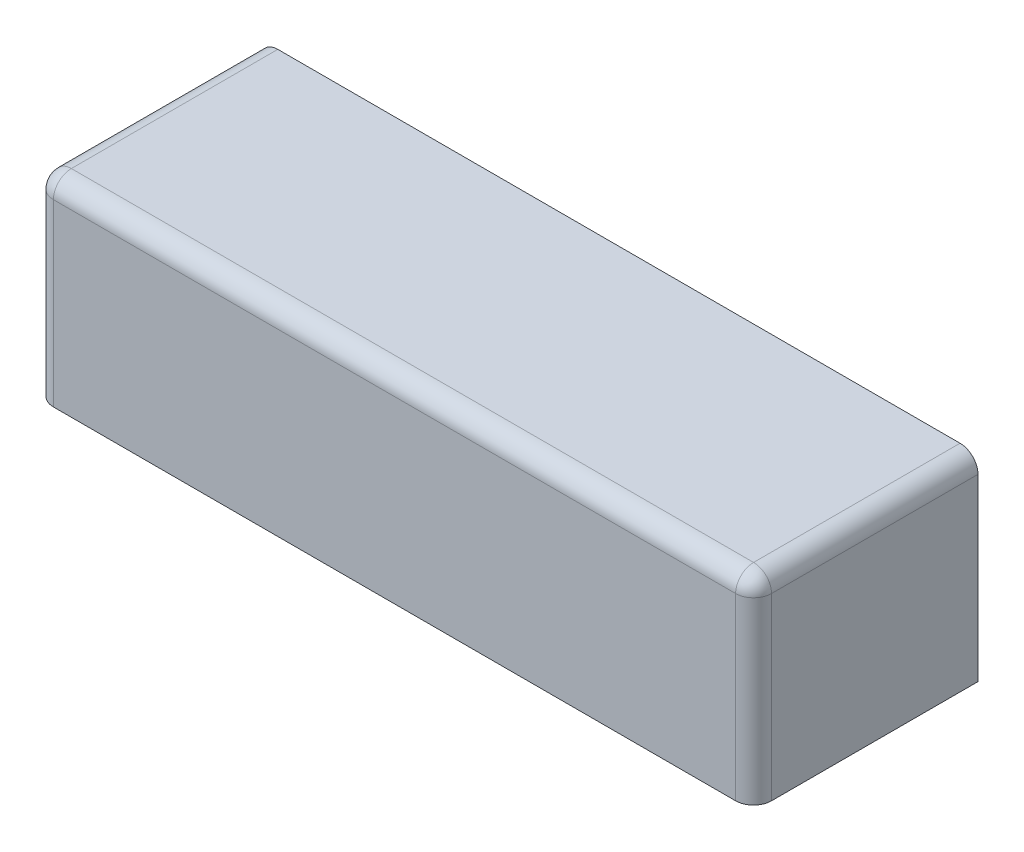
ISO-10303-21;
HEADER;
FILE_DESCRIPTION(('STEP AP214'),'2;1');
FILE_NAME('part.step','',(''),(''),'','','');
FILE_SCHEMA(('AUTOMOTIVE_DESIGN { 1 0 10303 214 1 1 1 1 }'));
ENDSEC;
DATA;
#1=APPLICATION_CONTEXT('core data for automotive mechanical design processes');
#2=APPLICATION_PROTOCOL_DEFINITION('international standard','automotive_design',2000,#1);
#3=PRODUCT_CONTEXT('',#1,'mechanical');
#4=PRODUCT('Part','Part','',(#3));
#5=PRODUCT_RELATED_PRODUCT_CATEGORY('part','',(#4));
#6=PRODUCT_DEFINITION_FORMATION('','',#4);
#7=PRODUCT_DEFINITION_CONTEXT('part definition',#1,'design');
#8=PRODUCT_DEFINITION('design','',#6,#7);
#9=PRODUCT_DEFINITION_SHAPE('','',#8);
#10=(LENGTH_UNIT() NAMED_UNIT(*) SI_UNIT(.MILLI.,.METRE.));
#11=(NAMED_UNIT(*) PLANE_ANGLE_UNIT() SI_UNIT($,.RADIAN.));
#12=(NAMED_UNIT(*) SI_UNIT($,.STERADIAN.) SOLID_ANGLE_UNIT());
#13=UNCERTAINTY_MEASURE_WITH_UNIT(LENGTH_MEASURE(1.E-05),#10,'distance_accuracy_value','');
#14=(GEOMETRIC_REPRESENTATION_CONTEXT(3) GLOBAL_UNCERTAINTY_ASSIGNED_CONTEXT((#13)) GLOBAL_UNIT_ASSIGNED_CONTEXT((#10,
#11,#12)) REPRESENTATION_CONTEXT('',''));
#15=CARTESIAN_POINT('',(0.,0.,0.));
#16=DIRECTION('',(0.,0.,1.));
#17=DIRECTION('',(1.,0.,0.));
#18=AXIS2_PLACEMENT_3D('',#15,#16,#17);
#19=CARTESIAN_POINT('',(-200.,-55.,125.));
#20=DIRECTION('',(0.,1.,0.));
#21=DIRECTION('',(0.,0.,1.));
#22=AXIS2_PLACEMENT_3D('',#19,#20,#21);
#23=PLANE('',#22);
#24=DIRECTION('',(0.,0.,-1.));
#25=VECTOR('',#24,1.);
#26=CARTESIAN_POINT('',(-197.,-55.,125.));
#27=LINE('',#26,#25);
#28=CARTESIAN_POINT('',(-197.,-55.,115.));
#29=VERTEX_POINT('',#28);
#30=CARTESIAN_POINT('',(-197.,-55.,0.));
#31=VERTEX_POINT('',#30);
#32=EDGE_CURVE('E199',#29,#31,#27,.T.);
#33=ORIENTED_EDGE('',*,*,#32,.F.);
#34=CARTESIAN_POINT('',(-190.,-55.,115.));
#35=DIRECTION('',(0.,1.,0.));
#36=DIRECTION('',(0.,0.,1.));
#37=AXIS2_PLACEMENT_3D('',#34,#35,#36);
#38=CIRCLE('',#37,7.);
#39=CARTESIAN_POINT('',(-190.,-55.,122.));
#40=VERTEX_POINT('',#39);
#41=EDGE_CURVE('E154',#40,#29,#38,.F.);
#42=ORIENTED_EDGE('',*,*,#41,.F.);
#43=DIRECTION('',(1.,0.,0.));
#44=VECTOR('',#43,1.);
#45=CARTESIAN_POINT('',(-200.,-55.,122.));
#46=LINE('',#45,#44);
#47=CARTESIAN_POINT('',(190.,-55.,122.));
#48=VERTEX_POINT('',#47);
#49=EDGE_CURVE('E204',#40,#48,#46,.T.);
#50=ORIENTED_EDGE('',*,*,#49,.T.);
#51=CARTESIAN_POINT('',(190.,-55.,115.));
#52=DIRECTION('',(0.,1.,0.));
#53=DIRECTION('',(0.,0.,1.));
#54=AXIS2_PLACEMENT_3D('',#51,#52,#53);
#55=CIRCLE('',#54,7.);
#56=CARTESIAN_POINT('',(197.,-55.,115.));
#57=VERTEX_POINT('',#56);
#58=EDGE_CURVE('E188',#57,#48,#55,.F.);
#59=ORIENTED_EDGE('',*,*,#58,.F.);
#60=DIRECTION('',(0.,0.,-1.));
#61=VECTOR('',#60,1.);
#62=CARTESIAN_POINT('',(197.,-55.,125.));
#63=LINE('',#62,#61);
#64=CARTESIAN_POINT('',(197.,-55.,0.));
#65=VERTEX_POINT('',#64);
#66=EDGE_CURVE('E159',#57,#65,#63,.T.);
#67=ORIENTED_EDGE('',*,*,#66,.T.);
#68=DIRECTION('',(1.,0.,0.));
#69=VECTOR('',#68,1.);
#70=CARTESIAN_POINT('',(-200.,-55.,0.));
#71=LINE('',#70,#69);
#72=CARTESIAN_POINT('',(200.,-55.,0.));
#73=VERTEX_POINT('',#72);
#74=EDGE_CURVE('E233',#65,#73,#71,.T.);
#75=ORIENTED_EDGE('',*,*,#74,.T.);
#76=DIRECTION('',(0.,0.,-1.));
#77=VECTOR('',#76,1.);
#78=CARTESIAN_POINT('',(200.,-55.,125.));
#79=LINE('',#78,#77);
#80=CARTESIAN_POINT('',(200.,-55.,115.));
#81=VERTEX_POINT('',#80);
#82=EDGE_CURVE('E223',#81,#73,#79,.T.);
#83=ORIENTED_EDGE('',*,*,#82,.F.);
#84=CARTESIAN_POINT('',(190.,-55.,115.));
#85=DIRECTION('',(0.,1.,0.));
#86=DIRECTION('',(0.,0.,1.));
#87=AXIS2_PLACEMENT_3D('',#84,#85,#86);
#88=CIRCLE('',#87,10.);
#89=CARTESIAN_POINT('',(190.,-55.,125.));
#90=VERTEX_POINT('',#89);
#91=EDGE_CURVE('E261',#81,#90,#88,.F.);
#92=ORIENTED_EDGE('',*,*,#91,.T.);
#93=DIRECTION('',(1.,0.,0.));
#94=VECTOR('',#93,1.);
#95=CARTESIAN_POINT('',(-200.,-55.,125.));
#96=LINE('',#95,#94);
#97=CARTESIAN_POINT('',(-190.,-55.,125.));
#98=VERTEX_POINT('',#97);
#99=EDGE_CURVE('E220',#98,#90,#96,.T.);
#100=ORIENTED_EDGE('',*,*,#99,.F.);
#101=CARTESIAN_POINT('',(-190.,-55.,115.));
#102=DIRECTION('',(0.,1.,0.));
#103=DIRECTION('',(0.,0.,1.));
#104=AXIS2_PLACEMENT_3D('',#101,#102,#103);
#105=CIRCLE('',#104,10.);
#106=CARTESIAN_POINT('',(-200.,-55.,115.));
#107=VERTEX_POINT('',#106);
#108=EDGE_CURVE('E263',#98,#107,#105,.F.);
#109=ORIENTED_EDGE('',*,*,#108,.T.);
#110=DIRECTION('',(0.,0.,-1.));
#111=VECTOR('',#110,1.);
#112=CARTESIAN_POINT('',(-200.,-55.,125.));
#113=LINE('',#112,#111);
#114=CARTESIAN_POINT('',(-200.,-55.,0.));
#115=VERTEX_POINT('',#114);
#116=EDGE_CURVE('E238',#107,#115,#113,.T.);
#117=ORIENTED_EDGE('',*,*,#116,.T.);
#118=EDGE_CURVE('E224',#115,#31,#71,.T.);
#119=ORIENTED_EDGE('',*,*,#118,.T.);
#120=EDGE_LOOP('',(#33,#42,#50,#59,#67,#75,#83,#92,#100,#109,#117,#119));
#121=FACE_BOUND('',#120,.T.);
#122=ADVANCED_FACE('F33',(#121),#23,.F.);
#123=CARTESIAN_POINT('',(200.,55.,125.));
#124=DIRECTION('',(-1.,0.,0.));
#125=DIRECTION('',(0.,0.,1.));
#126=AXIS2_PLACEMENT_3D('',#123,#124,#125);
#127=PLANE('',#126);
#128=DIRECTION('',(0.,0.,-1.));
#129=VECTOR('',#128,1.);
#130=CARTESIAN_POINT('',(200.,45.,125.));
#131=LINE('',#130,#129);
#132=CARTESIAN_POINT('',(200.,45.,0.));
#133=VERTEX_POINT('',#132);
#134=CARTESIAN_POINT('',(200.,45.,115.));
#135=VERTEX_POINT('',#134);
#136=EDGE_CURVE('E42',#133,#135,#131,.F.);
#137=ORIENTED_EDGE('',*,*,#136,.T.);
#138=DIRECTION('',(0.,1.,0.));
#139=VECTOR('',#138,1.);
#140=CARTESIAN_POINT('',(200.,-55.,115.));
#141=LINE('',#140,#139);
#142=EDGE_CURVE('E11',#135,#81,#141,.F.);
#143=ORIENTED_EDGE('',*,*,#142,.T.);
#144=ORIENTED_EDGE('',*,*,#82,.T.);
#145=DIRECTION('',(0.,1.,0.));
#146=VECTOR('',#145,1.);
#147=CARTESIAN_POINT('',(200.,55.,0.));
#148=LINE('',#147,#146);
#149=EDGE_CURVE('E225',#73,#133,#148,.T.);
#150=ORIENTED_EDGE('',*,*,#149,.T.);
#151=EDGE_LOOP('',(#137,#143,#144,#150));
#152=FACE_BOUND('',#151,.T.);
#153=ADVANCED_FACE('F347',(#152),#127,.F.);
#154=CARTESIAN_POINT('',(-200.,55.,125.));
#155=DIRECTION('',(0.,-1.,0.));
#156=DIRECTION('',(0.,0.,-1.));
#157=AXIS2_PLACEMENT_3D('',#154,#155,#156);
#158=PLANE('',#157);
#159=DIRECTION('',(-1.,0.,0.));
#160=VECTOR('',#159,1.);
#161=CARTESIAN_POINT('',(-200.,55.,0.));
#162=LINE('',#161,#160);
#163=CARTESIAN_POINT('',(190.,55.,0.));
#164=VERTEX_POINT('',#163);
#165=CARTESIAN_POINT('',(-190.,55.,0.));
#166=VERTEX_POINT('',#165);
#167=EDGE_CURVE('E227',#164,#166,#162,.T.);
#168=ORIENTED_EDGE('',*,*,#167,.T.);
#169=DIRECTION('',(0.,0.,-1.));
#170=VECTOR('',#169,1.);
#171=CARTESIAN_POINT('',(-190.,55.,125.));
#172=LINE('',#171,#170);
#173=CARTESIAN_POINT('',(-190.,55.,115.));
#174=VERTEX_POINT('',#173);
#175=EDGE_CURVE('E253',#166,#174,#172,.F.);
#176=ORIENTED_EDGE('',*,*,#175,.T.);
#177=DIRECTION('',(-1.,0.,0.));
#178=VECTOR('',#177,1.);
#179=CARTESIAN_POINT('',(200.,55.,115.));
#180=LINE('',#179,#178);
#181=CARTESIAN_POINT('',(190.,55.,115.));
#182=VERTEX_POINT('',#181);
#183=EDGE_CURVE('E249',#174,#182,#180,.F.);
#184=ORIENTED_EDGE('',*,*,#183,.T.);
#185=DIRECTION('',(0.,0.,-1.));
#186=VECTOR('',#185,1.);
#187=CARTESIAN_POINT('',(190.,55.,125.));
#188=LINE('',#187,#186);
#189=EDGE_CURVE('E251',#182,#164,#188,.T.);
#190=ORIENTED_EDGE('',*,*,#189,.T.);
#191=EDGE_LOOP('',(#168,#176,#184,#190));
#192=FACE_BOUND('',#191,.T.);
#193=ADVANCED_FACE('F349',(#192),#158,.F.);
#194=CARTESIAN_POINT('',(-200.,55.,125.));
#195=DIRECTION('',(1.,0.,0.));
#196=DIRECTION('',(0.,0.,-1.));
#197=AXIS2_PLACEMENT_3D('',#194,#195,#196);
#198=PLANE('',#197);
#199=DIRECTION('',(0.,-1.,0.));
#200=VECTOR('',#199,1.);
#201=CARTESIAN_POINT('',(-200.,55.,115.));
#202=LINE('',#201,#200);
#203=CARTESIAN_POINT('',(-200.,45.,115.));
#204=VERTEX_POINT('',#203);
#205=EDGE_CURVE('E240',#107,#204,#202,.F.);
#206=ORIENTED_EDGE('',*,*,#205,.T.);
#207=DIRECTION('',(0.,0.,-1.));
#208=VECTOR('',#207,1.);
#209=CARTESIAN_POINT('',(-200.,45.,125.));
#210=LINE('',#209,#208);
#211=CARTESIAN_POINT('',(-200.,45.,0.));
#212=VERTEX_POINT('',#211);
#213=EDGE_CURVE('E242',#204,#212,#210,.T.);
#214=ORIENTED_EDGE('',*,*,#213,.T.);
#215=DIRECTION('',(0.,-1.,0.));
#216=VECTOR('',#215,1.);
#217=CARTESIAN_POINT('',(-200.,55.,0.));
#218=LINE('',#217,#216);
#219=EDGE_CURVE('E230',#212,#115,#218,.T.);
#220=ORIENTED_EDGE('',*,*,#219,.T.);
#221=ORIENTED_EDGE('',*,*,#116,.F.);
#222=EDGE_LOOP('',(#206,#214,#220,#221));
#223=FACE_BOUND('',#222,.T.);
#224=ADVANCED_FACE('F306',(#223),#198,.F.);
#225=CARTESIAN_POINT('',(200.,-55.,125.));
#226=DIRECTION('',(0.,0.,1.));
#227=DIRECTION('',(1.,0.,0.));
#228=AXIS2_PLACEMENT_3D('',#225,#226,#227);
#229=PLANE('',#228);
#230=DIRECTION('',(-1.,0.,0.));
#231=VECTOR('',#230,1.);
#232=CARTESIAN_POINT('',(-200.,45.,125.));
#233=LINE('',#232,#231);
#234=CARTESIAN_POINT('',(190.,45.,125.));
#235=VERTEX_POINT('',#234);
#236=CARTESIAN_POINT('',(-190.,45.,125.));
#237=VERTEX_POINT('',#236);
#238=EDGE_CURVE('E255',#235,#237,#233,.T.);
#239=ORIENTED_EDGE('',*,*,#238,.T.);
#240=DIRECTION('',(0.,-1.,0.));
#241=VECTOR('',#240,1.);
#242=CARTESIAN_POINT('',(-190.,-55.,125.));
#243=LINE('',#242,#241);
#244=EDGE_CURVE('E259',#237,#98,#243,.T.);
#245=ORIENTED_EDGE('',*,*,#244,.T.);
#246=ORIENTED_EDGE('',*,*,#99,.T.);
#247=DIRECTION('',(0.,1.,0.));
#248=VECTOR('',#247,1.);
#249=CARTESIAN_POINT('',(190.,55.,125.));
#250=LINE('',#249,#248);
#251=EDGE_CURVE('E257',#90,#235,#250,.T.);
#252=ORIENTED_EDGE('',*,*,#251,.T.);
#253=EDGE_LOOP('',(#239,#245,#246,#252));
#254=FACE_BOUND('',#253,.T.);
#255=ADVANCED_FACE('F293',(#254),#229,.T.);
#256=CARTESIAN_POINT('',(200.,-55.,0.));
#257=DIRECTION('',(0.,0.,1.));
#258=DIRECTION('',(1.,0.,0.));
#259=AXIS2_PLACEMENT_3D('',#256,#257,#258);
#260=PLANE('',#259);
#261=CARTESIAN_POINT('',(-190.,45.,0.));
#262=DIRECTION('',(0.,0.,1.));
#263=DIRECTION('',(1.,0.,0.));
#264=AXIS2_PLACEMENT_3D('',#261,#262,#263);
#265=CIRCLE('',#264,7.);
#266=CARTESIAN_POINT('',(-197.,45.,0.));
#267=VERTEX_POINT('',#266);
#268=CARTESIAN_POINT('',(-190.,52.,0.));
#269=VERTEX_POINT('',#268);
#270=EDGE_CURVE('E214',#267,#269,#265,.F.);
#271=ORIENTED_EDGE('',*,*,#270,.F.);
#272=DIRECTION('',(0.,-1.,0.));
#273=VECTOR('',#272,1.);
#274=CARTESIAN_POINT('',(-197.,55.,0.));
#275=LINE('',#274,#273);
#276=EDGE_CURVE('E208',#267,#31,#275,.T.);
#277=ORIENTED_EDGE('',*,*,#276,.T.);
#278=ORIENTED_EDGE('',*,*,#118,.F.);
#279=ORIENTED_EDGE('',*,*,#219,.F.);
#280=CARTESIAN_POINT('',(-190.,45.,0.));
#281=DIRECTION('',(0.,0.,1.));
#282=DIRECTION('',(1.,0.,0.));
#283=AXIS2_PLACEMENT_3D('',#280,#281,#282);
#284=CIRCLE('',#283,10.);
#285=EDGE_CURVE('E247',#212,#166,#284,.F.);
#286=ORIENTED_EDGE('',*,*,#285,.T.);
#287=ORIENTED_EDGE('',*,*,#167,.F.);
#288=CARTESIAN_POINT('',(190.,45.,0.));
#289=DIRECTION('',(0.,0.,1.));
#290=DIRECTION('',(1.,0.,0.));
#291=AXIS2_PLACEMENT_3D('',#288,#289,#290);
#292=CIRCLE('',#291,10.);
#293=EDGE_CURVE('E245',#164,#133,#292,.F.);
#294=ORIENTED_EDGE('',*,*,#293,.T.);
#295=ORIENTED_EDGE('',*,*,#149,.F.);
#296=ORIENTED_EDGE('',*,*,#74,.F.);
#297=DIRECTION('',(0.,1.,0.));
#298=VECTOR('',#297,1.);
#299=CARTESIAN_POINT('',(197.,55.,0.));
#300=LINE('',#299,#298);
#301=CARTESIAN_POINT('',(197.,45.,0.));
#302=VERTEX_POINT('',#301);
#303=EDGE_CURVE('E171',#65,#302,#300,.T.);
#304=ORIENTED_EDGE('',*,*,#303,.T.);
#305=CARTESIAN_POINT('',(190.,45.,0.));
#306=DIRECTION('',(0.,0.,1.));
#307=DIRECTION('',(1.,0.,0.));
#308=AXIS2_PLACEMENT_3D('',#305,#306,#307);
#309=CIRCLE('',#308,7.);
#310=CARTESIAN_POINT('',(190.,52.,0.));
#311=VERTEX_POINT('',#310);
#312=EDGE_CURVE('E151',#311,#302,#309,.F.);
#313=ORIENTED_EDGE('',*,*,#312,.F.);
#314=DIRECTION('',(-1.,0.,0.));
#315=VECTOR('',#314,1.);
#316=CARTESIAN_POINT('',(-200.,52.,0.));
#317=LINE('',#316,#315);
#318=EDGE_CURVE('E213',#311,#269,#317,.T.);
#319=ORIENTED_EDGE('',*,*,#318,.T.);
#320=EDGE_LOOP('',(#271,#277,#278,#279,#286,#287,#294,#295,#296,#304,#313,#319));
#321=FACE_BOUND('',#320,.T.);
#322=ADVANCED_FACE('F312',(#321),#260,.F.);
#323=CARTESIAN_POINT('',(190.,45.,125.));
#324=DIRECTION('',(0.,0.,-1.));
#325=DIRECTION('',(-1.,0.,0.));
#326=AXIS2_PLACEMENT_3D('',#323,#324,#325);
#327=CYLINDRICAL_SURFACE('',#326,10.);
#328=ORIENTED_EDGE('',*,*,#293,.F.);
#329=ORIENTED_EDGE('',*,*,#189,.F.);
#330=CARTESIAN_POINT('',(190.,45.,115.));
#331=DIRECTION('',(0.,0.,1.));
#332=DIRECTION('',(1.,0.,0.));
#333=AXIS2_PLACEMENT_3D('',#330,#331,#332);
#334=CIRCLE('',#333,10.);
#335=EDGE_CURVE('E37',#135,#182,#334,.T.);
#336=ORIENTED_EDGE('',*,*,#335,.F.);
#337=ORIENTED_EDGE('',*,*,#136,.F.);
#338=EDGE_LOOP('',(#328,#329,#336,#337));
#339=FACE_BOUND('',#338,.T.);
#340=ADVANCED_FACE('F35',(#339),#327,.T.);
#341=CARTESIAN_POINT('',(190.,-55.,115.));
#342=DIRECTION('',(0.,-1.,0.));
#343=DIRECTION('',(0.,0.,-1.));
#344=AXIS2_PLACEMENT_3D('',#341,#342,#343);
#345=CYLINDRICAL_SURFACE('',#344,10.);
#346=ORIENTED_EDGE('',*,*,#91,.F.);
#347=ORIENTED_EDGE('',*,*,#142,.F.);
#348=CARTESIAN_POINT('',(190.,45.,115.));
#349=DIRECTION('',(0.,1.,0.));
#350=DIRECTION('',(-1.,0.,0.));
#351=AXIS2_PLACEMENT_3D('',#348,#349,#350);
#352=CIRCLE('',#351,10.);
#353=EDGE_CURVE('E276',#235,#135,#352,.T.);
#354=ORIENTED_EDGE('',*,*,#353,.F.);
#355=ORIENTED_EDGE('',*,*,#251,.F.);
#356=EDGE_LOOP('',(#346,#347,#354,#355));
#357=FACE_BOUND('',#356,.T.);
#358=ADVANCED_FACE('F400',(#357),#345,.T.);
#359=CARTESIAN_POINT('',(190.,45.,115.));
#360=DIRECTION('',(0.,0.,1.));
#361=DIRECTION('',(1.,0.,0.));
#362=AXIS2_PLACEMENT_3D('',#359,#360,#361);
#363=SPHERICAL_SURFACE('',#362,10.);
#364=ORIENTED_EDGE('',*,*,#353,.T.);
#365=ORIENTED_EDGE('',*,*,#335,.T.);
#366=CARTESIAN_POINT('',(190.,45.,115.));
#367=DIRECTION('',(1.,0.,0.));
#368=DIRECTION('',(0.,0.,-1.));
#369=AXIS2_PLACEMENT_3D('',#366,#367,#368);
#370=CIRCLE('',#369,10.);
#371=EDGE_CURVE('E274',#235,#182,#370,.F.);
#372=ORIENTED_EDGE('',*,*,#371,.F.);
#373=EDGE_LOOP('',(#364,#365,#372));
#374=FACE_BOUND('',#373,.T.);
#375=ADVANCED_FACE('F283',(#374),#363,.T.);
#376=CARTESIAN_POINT('',(200.,45.,115.));
#377=DIRECTION('',(1.,0.,0.));
#378=DIRECTION('',(0.,0.,-1.));
#379=AXIS2_PLACEMENT_3D('',#376,#377,#378);
#380=CYLINDRICAL_SURFACE('',#379,10.);
#381=ORIENTED_EDGE('',*,*,#371,.T.);
#382=ORIENTED_EDGE('',*,*,#183,.F.);
#383=CARTESIAN_POINT('',(-190.,45.,115.));
#384=DIRECTION('',(-1.,0.,0.));
#385=DIRECTION('',(0.,0.,1.));
#386=AXIS2_PLACEMENT_3D('',#383,#384,#385);
#387=CIRCLE('',#386,10.);
#388=EDGE_CURVE('E271',#237,#174,#387,.T.);
#389=ORIENTED_EDGE('',*,*,#388,.F.);
#390=ORIENTED_EDGE('',*,*,#238,.F.);
#391=EDGE_LOOP('',(#381,#382,#389,#390));
#392=FACE_BOUND('',#391,.T.);
#393=ADVANCED_FACE('F289',(#392),#380,.T.);
#394=CARTESIAN_POINT('',(-190.,-55.,115.));
#395=DIRECTION('',(0.,1.,0.));
#396=DIRECTION('',(0.,0.,1.));
#397=AXIS2_PLACEMENT_3D('',#394,#395,#396);
#398=CYLINDRICAL_SURFACE('',#397,10.);
#399=ORIENTED_EDGE('',*,*,#108,.F.);
#400=ORIENTED_EDGE('',*,*,#244,.F.);
#401=CARTESIAN_POINT('',(-190.,45.,115.));
#402=DIRECTION('',(0.,1.,0.));
#403=DIRECTION('',(0.,0.,1.));
#404=AXIS2_PLACEMENT_3D('',#401,#402,#403);
#405=CIRCLE('',#404,10.);
#406=EDGE_CURVE('E268',#204,#237,#405,.T.);
#407=ORIENTED_EDGE('',*,*,#406,.F.);
#408=ORIENTED_EDGE('',*,*,#205,.F.);
#409=EDGE_LOOP('',(#399,#400,#407,#408));
#410=FACE_BOUND('',#409,.T.);
#411=ADVANCED_FACE('F299',(#410),#398,.T.);
#412=CARTESIAN_POINT('',(-190.,45.,115.));
#413=DIRECTION('',(0.,0.,1.));
#414=DIRECTION('',(1.,0.,0.));
#415=AXIS2_PLACEMENT_3D('',#412,#413,#414);
#416=SPHERICAL_SURFACE('',#415,10.);
#417=ORIENTED_EDGE('',*,*,#406,.T.);
#418=ORIENTED_EDGE('',*,*,#388,.T.);
#419=CARTESIAN_POINT('',(-190.,45.,115.));
#420=DIRECTION('',(0.,0.,1.));
#421=DIRECTION('',(1.,0.,0.));
#422=AXIS2_PLACEMENT_3D('',#419,#420,#421);
#423=CIRCLE('',#422,10.);
#424=EDGE_CURVE('E163',#204,#174,#423,.F.);
#425=ORIENTED_EDGE('',*,*,#424,.F.);
#426=EDGE_LOOP('',(#417,#418,#425));
#427=FACE_BOUND('',#426,.T.);
#428=ADVANCED_FACE('F354',(#427),#416,.T.);
#429=CARTESIAN_POINT('',(-190.,45.,125.));
#430=DIRECTION('',(0.,0.,-1.));
#431=DIRECTION('',(-1.,0.,0.));
#432=AXIS2_PLACEMENT_3D('',#429,#430,#431);
#433=CYLINDRICAL_SURFACE('',#432,10.);
#434=ORIENTED_EDGE('',*,*,#424,.T.);
#435=ORIENTED_EDGE('',*,*,#175,.F.);
#436=ORIENTED_EDGE('',*,*,#285,.F.);
#437=ORIENTED_EDGE('',*,*,#213,.F.);
#438=EDGE_LOOP('',(#434,#435,#436,#437));
#439=FACE_BOUND('',#438,.T.);
#440=ADVANCED_FACE('F352',(#439),#433,.T.);
#441=CARTESIAN_POINT('',(197.,55.,125.));
#442=DIRECTION('',(-1.,0.,0.));
#443=DIRECTION('',(0.,0.,1.));
#444=AXIS2_PLACEMENT_3D('',#441,#442,#443);
#445=PLANE('',#444);
#446=DIRECTION('',(0.,0.,1.));
#447=VECTOR('',#446,1.);
#448=CARTESIAN_POINT('',(197.,45.,125.));
#449=LINE('',#448,#447);
#450=CARTESIAN_POINT('',(197.,45.,115.));
#451=VERTEX_POINT('',#450);
#452=EDGE_CURVE('E50',#302,#451,#449,.T.);
#453=ORIENTED_EDGE('',*,*,#452,.F.);
#454=ORIENTED_EDGE('',*,*,#303,.F.);
#455=ORIENTED_EDGE('',*,*,#66,.F.);
#456=DIRECTION('',(0.,1.,0.));
#457=VECTOR('',#456,1.);
#458=CARTESIAN_POINT('',(197.,55.,115.));
#459=LINE('',#458,#457);
#460=EDGE_CURVE('E153',#451,#57,#459,.F.);
#461=ORIENTED_EDGE('',*,*,#460,.F.);
#462=EDGE_LOOP('',(#453,#454,#455,#461));
#463=FACE_BOUND('',#462,.T.);
#464=ADVANCED_FACE('F157',(#463),#445,.T.);
#465=CARTESIAN_POINT('',(-200.,52.,125.));
#466=DIRECTION('',(0.,-1.,0.));
#467=DIRECTION('',(0.,0.,-1.));
#468=AXIS2_PLACEMENT_3D('',#465,#466,#467);
#469=PLANE('',#468);
#470=ORIENTED_EDGE('',*,*,#318,.F.);
#471=DIRECTION('',(0.,0.,-1.));
#472=VECTOR('',#471,1.);
#473=CARTESIAN_POINT('',(190.,52.,125.));
#474=LINE('',#473,#472);
#475=CARTESIAN_POINT('',(190.,52.,115.));
#476=VERTEX_POINT('',#475);
#477=EDGE_CURVE('E332',#476,#311,#474,.T.);
#478=ORIENTED_EDGE('',*,*,#477,.F.);
#479=DIRECTION('',(1.,0.,0.));
#480=VECTOR('',#479,1.);
#481=CARTESIAN_POINT('',(-200.,52.,115.));
#482=LINE('',#481,#480);
#483=CARTESIAN_POINT('',(-190.,52.,115.));
#484=VERTEX_POINT('',#483);
#485=EDGE_CURVE('E180',#484,#476,#482,.T.);
#486=ORIENTED_EDGE('',*,*,#485,.F.);
#487=DIRECTION('',(0.,0.,-1.));
#488=VECTOR('',#487,1.);
#489=CARTESIAN_POINT('',(-190.,52.,125.));
#490=LINE('',#489,#488);
#491=EDGE_CURVE('E185',#269,#484,#490,.F.);
#492=ORIENTED_EDGE('',*,*,#491,.F.);
#493=EDGE_LOOP('',(#470,#478,#486,#492));
#494=FACE_BOUND('',#493,.T.);
#495=ADVANCED_FACE('F334',(#494),#469,.T.);
#496=CARTESIAN_POINT('',(-197.,55.,125.));
#497=DIRECTION('',(1.,0.,0.));
#498=DIRECTION('',(0.,0.,-1.));
#499=AXIS2_PLACEMENT_3D('',#496,#497,#498);
#500=PLANE('',#499);
#501=DIRECTION('',(0.,1.,0.));
#502=VECTOR('',#501,1.);
#503=CARTESIAN_POINT('',(-197.,55.,115.));
#504=LINE('',#503,#502);
#505=CARTESIAN_POINT('',(-197.,45.,115.));
#506=VERTEX_POINT('',#505);
#507=EDGE_CURVE('E196',#29,#506,#504,.T.);
#508=ORIENTED_EDGE('',*,*,#507,.F.);
#509=ORIENTED_EDGE('',*,*,#32,.T.);
#510=ORIENTED_EDGE('',*,*,#276,.F.);
#511=DIRECTION('',(0.,0.,-1.));
#512=VECTOR('',#511,1.);
#513=CARTESIAN_POINT('',(-197.,45.,125.));
#514=LINE('',#513,#512);
#515=EDGE_CURVE('E198',#506,#267,#514,.T.);
#516=ORIENTED_EDGE('',*,*,#515,.F.);
#517=EDGE_LOOP('',(#508,#509,#510,#516));
#518=FACE_BOUND('',#517,.T.);
#519=ADVANCED_FACE('F317',(#518),#500,.T.);
#520=CARTESIAN_POINT('',(200.,-55.,122.));
#521=DIRECTION('',(0.,0.,1.));
#522=DIRECTION('',(1.,0.,0.));
#523=AXIS2_PLACEMENT_3D('',#520,#521,#522);
#524=PLANE('',#523);
#525=DIRECTION('',(1.,0.,0.));
#526=VECTOR('',#525,1.);
#527=CARTESIAN_POINT('',(200.,45.,122.));
#528=LINE('',#527,#526);
#529=CARTESIAN_POINT('',(190.,45.,122.));
#530=VERTEX_POINT('',#529);
#531=CARTESIAN_POINT('',(-190.,45.,122.));
#532=VERTEX_POINT('',#531);
#533=EDGE_CURVE('E183',#530,#532,#528,.F.);
#534=ORIENTED_EDGE('',*,*,#533,.F.);
#535=DIRECTION('',(0.,1.,0.));
#536=VECTOR('',#535,1.);
#537=CARTESIAN_POINT('',(190.,-55.,122.));
#538=LINE('',#537,#536);
#539=EDGE_CURVE('E175',#48,#530,#538,.T.);
#540=ORIENTED_EDGE('',*,*,#539,.F.);
#541=ORIENTED_EDGE('',*,*,#49,.F.);
#542=DIRECTION('',(0.,1.,0.));
#543=VECTOR('',#542,1.);
#544=CARTESIAN_POINT('',(-190.,-55.,122.));
#545=LINE('',#544,#543);
#546=EDGE_CURVE('E186',#532,#40,#545,.F.);
#547=ORIENTED_EDGE('',*,*,#546,.F.);
#548=EDGE_LOOP('',(#534,#540,#541,#547));
#549=FACE_BOUND('',#548,.T.);
#550=ADVANCED_FACE('F341',(#549),#524,.F.);
#551=CARTESIAN_POINT('',(190.,45.,125.));
#552=DIRECTION('',(0.,0.,-1.));
#553=DIRECTION('',(-1.,0.,0.));
#554=AXIS2_PLACEMENT_3D('',#551,#552,#553);
#555=CYLINDRICAL_SURFACE('',#554,7.);
#556=ORIENTED_EDGE('',*,*,#312,.T.);
#557=ORIENTED_EDGE('',*,*,#452,.T.);
#558=CARTESIAN_POINT('',(190.,45.,115.));
#559=DIRECTION('',(0.,0.,1.));
#560=DIRECTION('',(1.,0.,0.));
#561=AXIS2_PLACEMENT_3D('',#558,#559,#560);
#562=CIRCLE('',#561,7.);
#563=EDGE_CURVE('E148',#451,#476,#562,.T.);
#564=ORIENTED_EDGE('',*,*,#563,.T.);
#565=ORIENTED_EDGE('',*,*,#477,.T.);
#566=EDGE_LOOP('',(#556,#557,#564,#565));
#567=FACE_BOUND('',#566,.T.);
#568=ADVANCED_FACE('F146',(#567),#555,.F.);
#569=CARTESIAN_POINT('',(190.,-55.,115.));
#570=DIRECTION('',(0.,-1.,0.));
#571=DIRECTION('',(0.,0.,-1.));
#572=AXIS2_PLACEMENT_3D('',#569,#570,#571);
#573=CYLINDRICAL_SURFACE('',#572,7.);
#574=ORIENTED_EDGE('',*,*,#58,.T.);
#575=ORIENTED_EDGE('',*,*,#539,.T.);
#576=CARTESIAN_POINT('',(190.,45.,115.));
#577=DIRECTION('',(0.,-1.,0.));
#578=DIRECTION('',(0.,0.,-1.));
#579=AXIS2_PLACEMENT_3D('',#576,#577,#578);
#580=CIRCLE('',#579,7.);
#581=EDGE_CURVE('E168',#530,#451,#580,.F.);
#582=ORIENTED_EDGE('',*,*,#581,.T.);
#583=ORIENTED_EDGE('',*,*,#460,.T.);
#584=EDGE_LOOP('',(#574,#575,#582,#583));
#585=FACE_BOUND('',#584,.T.);
#586=ADVANCED_FACE('F173',(#585),#573,.F.);
#587=CARTESIAN_POINT('',(190.,45.,115.));
#588=DIRECTION('',(0.,0.,1.));
#589=DIRECTION('',(1.,0.,0.));
#590=AXIS2_PLACEMENT_3D('',#587,#588,#589);
#591=SPHERICAL_SURFACE('',#590,7.);
#592=ORIENTED_EDGE('',*,*,#581,.F.);
#593=CARTESIAN_POINT('',(190.,45.,115.));
#594=DIRECTION('',(1.,0.,0.));
#595=DIRECTION('',(0.,0.,-1.));
#596=AXIS2_PLACEMENT_3D('',#593,#594,#595);
#597=CIRCLE('',#596,7.);
#598=EDGE_CURVE('E170',#530,#476,#597,.F.);
#599=ORIENTED_EDGE('',*,*,#598,.T.);
#600=ORIENTED_EDGE('',*,*,#563,.F.);
#601=EDGE_LOOP('',(#592,#599,#600));
#602=FACE_BOUND('',#601,.T.);
#603=ADVANCED_FACE('F167',(#602),#591,.F.);
#604=CARTESIAN_POINT('',(200.,45.,115.));
#605=DIRECTION('',(1.,0.,0.));
#606=DIRECTION('',(0.,0.,-1.));
#607=AXIS2_PLACEMENT_3D('',#604,#605,#606);
#608=CYLINDRICAL_SURFACE('',#607,7.);
#609=ORIENTED_EDGE('',*,*,#598,.F.);
#610=ORIENTED_EDGE('',*,*,#533,.T.);
#611=CARTESIAN_POINT('',(-190.,45.,115.));
#612=DIRECTION('',(1.,0.,0.));
#613=DIRECTION('',(0.,1.,0.));
#614=AXIS2_PLACEMENT_3D('',#611,#612,#613);
#615=CIRCLE('',#614,7.);
#616=EDGE_CURVE('E177',#532,#484,#615,.F.);
#617=ORIENTED_EDGE('',*,*,#616,.T.);
#618=ORIENTED_EDGE('',*,*,#485,.T.);
#619=EDGE_LOOP('',(#609,#610,#617,#618));
#620=FACE_BOUND('',#619,.T.);
#621=ADVANCED_FACE('F336',(#620),#608,.F.);
#622=CARTESIAN_POINT('',(-190.,-55.,115.));
#623=DIRECTION('',(0.,1.,0.));
#624=DIRECTION('',(0.,0.,1.));
#625=AXIS2_PLACEMENT_3D('',#622,#623,#624);
#626=CYLINDRICAL_SURFACE('',#625,7.);
#627=ORIENTED_EDGE('',*,*,#41,.T.);
#628=ORIENTED_EDGE('',*,*,#507,.T.);
#629=CARTESIAN_POINT('',(-190.,45.,115.));
#630=DIRECTION('',(0.,1.,0.));
#631=DIRECTION('',(-1.,0.,0.));
#632=AXIS2_PLACEMENT_3D('',#629,#630,#631);
#633=CIRCLE('',#632,7.);
#634=EDGE_CURVE('E192',#506,#532,#633,.T.);
#635=ORIENTED_EDGE('',*,*,#634,.T.);
#636=ORIENTED_EDGE('',*,*,#546,.T.);
#637=EDGE_LOOP('',(#627,#628,#635,#636));
#638=FACE_BOUND('',#637,.T.);
#639=ADVANCED_FACE('F321',(#638),#626,.F.);
#640=CARTESIAN_POINT('',(-190.,45.,115.));
#641=DIRECTION('',(0.,0.,1.));
#642=DIRECTION('',(1.,0.,0.));
#643=AXIS2_PLACEMENT_3D('',#640,#641,#642);
#644=SPHERICAL_SURFACE('',#643,7.);
#645=ORIENTED_EDGE('',*,*,#634,.F.);
#646=CARTESIAN_POINT('',(-190.,45.,115.));
#647=DIRECTION('',(0.,0.,-1.));
#648=DIRECTION('',(-1.,0.,0.));
#649=AXIS2_PLACEMENT_3D('',#646,#647,#648);
#650=CIRCLE('',#649,7.);
#651=EDGE_CURVE('E195',#506,#484,#650,.T.);
#652=ORIENTED_EDGE('',*,*,#651,.T.);
#653=ORIENTED_EDGE('',*,*,#616,.F.);
#654=EDGE_LOOP('',(#645,#652,#653));
#655=FACE_BOUND('',#654,.T.);
#656=ADVANCED_FACE('F325',(#655),#644,.F.);
#657=CARTESIAN_POINT('',(-190.,45.,125.));
#658=DIRECTION('',(0.,0.,-1.));
#659=DIRECTION('',(-1.,0.,0.));
#660=AXIS2_PLACEMENT_3D('',#657,#658,#659);
#661=CYLINDRICAL_SURFACE('',#660,7.);
#662=ORIENTED_EDGE('',*,*,#651,.F.);
#663=ORIENTED_EDGE('',*,*,#515,.T.);
#664=ORIENTED_EDGE('',*,*,#270,.T.);
#665=ORIENTED_EDGE('',*,*,#491,.T.);
#666=EDGE_LOOP('',(#662,#663,#664,#665));
#667=FACE_BOUND('',#666,.T.);
#668=ADVANCED_FACE('F327',(#667),#661,.F.);
#669=CLOSED_SHELL('',(#122,#153,#193,#224,#255,#322,#340,#358,#375,#393,#411,#428,#440,#464,
#495,#519,#550,#568,#586,#603,#621,#639,#656,#668));
#670=MANIFOLD_SOLID_BREP('B2',#669);
#671=ADVANCED_BREP_SHAPE_REPRESENTATION('',(#18,#670),#14);
#672=SHAPE_DEFINITION_REPRESENTATION(#9,#671);
ENDSEC;
END-ISO-10303-21;
